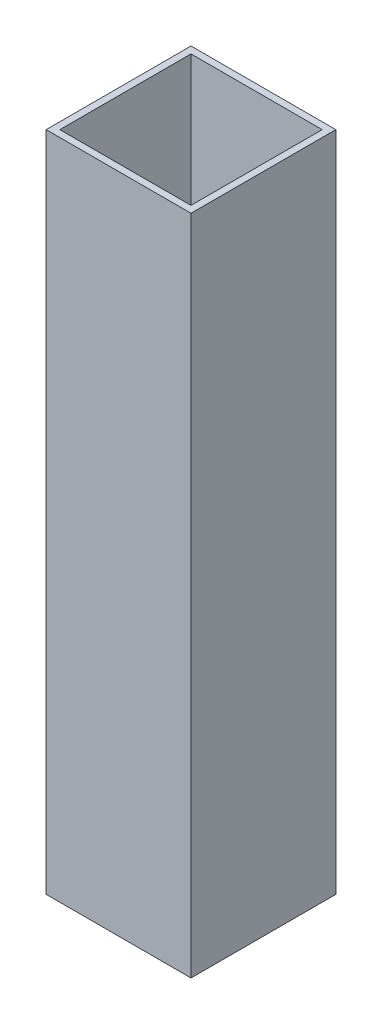
ISO-10303-21;
HEADER;
FILE_DESCRIPTION(('STEP AP214'),'2;1');
FILE_NAME('part.step','',(''),(''),'','','');
FILE_SCHEMA(('AUTOMOTIVE_DESIGN { 1 0 10303 214 1 1 1 1 }'));
ENDSEC;
DATA;
#1=APPLICATION_CONTEXT('core data for automotive mechanical design processes');
#2=APPLICATION_PROTOCOL_DEFINITION('international standard','automotive_design',2000,#1);
#3=PRODUCT_CONTEXT('',#1,'mechanical');
#4=PRODUCT('Part','Part','',(#3));
#5=PRODUCT_RELATED_PRODUCT_CATEGORY('part','',(#4));
#6=PRODUCT_DEFINITION_FORMATION('','',#4);
#7=PRODUCT_DEFINITION_CONTEXT('part definition',#1,'design');
#8=PRODUCT_DEFINITION('design','',#6,#7);
#9=PRODUCT_DEFINITION_SHAPE('','',#8);
#10=(LENGTH_UNIT() NAMED_UNIT(*) SI_UNIT(.MILLI.,.METRE.));
#11=(NAMED_UNIT(*) PLANE_ANGLE_UNIT() SI_UNIT($,.RADIAN.));
#12=(NAMED_UNIT(*) SI_UNIT($,.STERADIAN.) SOLID_ANGLE_UNIT());
#13=UNCERTAINTY_MEASURE_WITH_UNIT(LENGTH_MEASURE(1.E-05),#10,'distance_accuracy_value','');
#14=(GEOMETRIC_REPRESENTATION_CONTEXT(3) GLOBAL_UNCERTAINTY_ASSIGNED_CONTEXT((#13)) GLOBAL_UNIT_ASSIGNED_CONTEXT((#10,
#11,#12)) REPRESENTATION_CONTEXT('',''));
#15=CARTESIAN_POINT('',(0.,0.,0.));
#16=DIRECTION('',(0.,0.,1.));
#17=DIRECTION('',(1.,0.,0.));
#18=AXIS2_PLACEMENT_3D('',#15,#16,#17);
#19=CARTESIAN_POINT('',(0.,116.13,0.));
#20=DIRECTION('',(0.,1.,0.));
#21=DIRECTION('',(0.,0.,1.));
#22=AXIS2_PLACEMENT_3D('',#19,#20,#21);
#23=PLANE('',#22);
#24=DIRECTION('',(0.,0.,1.));
#25=VECTOR('',#24,1.);
#26=CARTESIAN_POINT('',(0.,116.13,-25.4));
#27=LINE('',#26,#25);
#28=CARTESIAN_POINT('',(0.,116.13,-25.4));
#29=VERTEX_POINT('',#28);
#30=CARTESIAN_POINT('',(0.,116.13,0.));
#31=VERTEX_POINT('',#30);
#32=EDGE_CURVE('E157',#29,#31,#27,.T.);
#33=ORIENTED_EDGE('',*,*,#32,.T.);
#34=DIRECTION('',(1.,0.,0.));
#35=VECTOR('',#34,1.);
#36=CARTESIAN_POINT('',(0.,116.13,0.));
#37=LINE('',#36,#35);
#38=CARTESIAN_POINT('',(25.4,116.13,0.));
#39=VERTEX_POINT('',#38);
#40=EDGE_CURVE('E161',#31,#39,#37,.T.);
#41=ORIENTED_EDGE('',*,*,#40,.T.);
#42=DIRECTION('',(0.,0.,-1.));
#43=VECTOR('',#42,1.);
#44=CARTESIAN_POINT('',(25.4,116.13,0.));
#45=LINE('',#44,#43);
#46=CARTESIAN_POINT('',(25.4,116.13,-25.4));
#47=VERTEX_POINT('',#46);
#48=EDGE_CURVE('E165',#39,#47,#45,.T.);
#49=ORIENTED_EDGE('',*,*,#48,.T.);
#50=DIRECTION('',(-1.,0.,0.));
#51=VECTOR('',#50,1.);
#52=CARTESIAN_POINT('',(25.4,116.13,-25.4));
#53=LINE('',#52,#51);
#54=EDGE_CURVE('E168',#47,#29,#53,.T.);
#55=ORIENTED_EDGE('',*,*,#54,.T.);
#56=EDGE_LOOP('',(#33,#41,#49,#55));
#57=FACE_BOUND('',#56,.T.);
#58=DIRECTION('',(0.,0.,1.));
#59=VECTOR('',#58,1.);
#60=CARTESIAN_POINT('',(1.2,116.13,-24.2));
#61=LINE('',#60,#59);
#62=CARTESIAN_POINT('',(1.2,116.13,-24.2));
#63=VERTEX_POINT('',#62);
#64=CARTESIAN_POINT('',(1.2,116.13,-1.2));
#65=VERTEX_POINT('',#64);
#66=EDGE_CURVE('E118',#63,#65,#61,.T.);
#67=ORIENTED_EDGE('',*,*,#66,.F.);
#68=DIRECTION('',(-1.,0.,0.));
#69=VECTOR('',#68,1.);
#70=CARTESIAN_POINT('',(24.2,116.13,-24.2));
#71=LINE('',#70,#69);
#72=CARTESIAN_POINT('',(24.2,116.13,-24.2));
#73=VERTEX_POINT('',#72);
#74=EDGE_CURVE('E109',#73,#63,#71,.T.);
#75=ORIENTED_EDGE('',*,*,#74,.F.);
#76=DIRECTION('',(0.,0.,-1.));
#77=VECTOR('',#76,1.);
#78=CARTESIAN_POINT('',(24.2,116.13,-1.2));
#79=LINE('',#78,#77);
#80=CARTESIAN_POINT('',(24.2,116.13,-1.2));
#81=VERTEX_POINT('',#80);
#82=EDGE_CURVE('E135',#81,#73,#79,.T.);
#83=ORIENTED_EDGE('',*,*,#82,.F.);
#84=DIRECTION('',(1.,0.,0.));
#85=VECTOR('',#84,1.);
#86=CARTESIAN_POINT('',(1.2,116.13,-1.2));
#87=LINE('',#86,#85);
#88=EDGE_CURVE('E131',#65,#81,#87,.T.);
#89=ORIENTED_EDGE('',*,*,#88,.F.);
#90=EDGE_LOOP('',(#67,#75,#83,#89));
#91=FACE_BOUND('',#90,.T.);
#92=ADVANCED_FACE('F43',(#57,#91),#23,.T.);
#93=CARTESIAN_POINT('',(0.,0.,0.));
#94=DIRECTION('',(0.,1.,0.));
#95=DIRECTION('',(0.,0.,1.));
#96=AXIS2_PLACEMENT_3D('',#93,#94,#95);
#97=PLANE('',#96);
#98=DIRECTION('',(0.,0.,1.));
#99=VECTOR('',#98,1.);
#100=CARTESIAN_POINT('',(0.,0.,-25.4));
#101=LINE('',#100,#99);
#102=CARTESIAN_POINT('',(0.,0.,-25.4));
#103=VERTEX_POINT('',#102);
#104=CARTESIAN_POINT('',(0.,0.,0.));
#105=VERTEX_POINT('',#104);
#106=EDGE_CURVE('E127',#103,#105,#101,.T.);
#107=ORIENTED_EDGE('',*,*,#106,.F.);
#108=DIRECTION('',(-1.,0.,0.));
#109=VECTOR('',#108,1.);
#110=CARTESIAN_POINT('',(25.4,0.,-25.4));
#111=LINE('',#110,#109);
#112=CARTESIAN_POINT('',(25.4,0.,-25.4));
#113=VERTEX_POINT('',#112);
#114=EDGE_CURVE('E162',#113,#103,#111,.T.);
#115=ORIENTED_EDGE('',*,*,#114,.F.);
#116=DIRECTION('',(0.,0.,-1.));
#117=VECTOR('',#116,1.);
#118=CARTESIAN_POINT('',(25.4,0.,0.));
#119=LINE('',#118,#117);
#120=CARTESIAN_POINT('',(25.4,0.,0.));
#121=VERTEX_POINT('',#120);
#122=EDGE_CURVE('E178',#121,#113,#119,.T.);
#123=ORIENTED_EDGE('',*,*,#122,.F.);
#124=DIRECTION('',(1.,0.,0.));
#125=VECTOR('',#124,1.);
#126=CARTESIAN_POINT('',(0.,0.,0.));
#127=LINE('',#126,#125);
#128=EDGE_CURVE('E175',#105,#121,#127,.T.);
#129=ORIENTED_EDGE('',*,*,#128,.F.);
#130=EDGE_LOOP('',(#107,#115,#123,#129));
#131=FACE_BOUND('',#130,.T.);
#132=DIRECTION('',(-1.,0.,0.));
#133=VECTOR('',#132,1.);
#134=CARTESIAN_POINT('',(24.2,0.,-24.2));
#135=LINE('',#134,#133);
#136=CARTESIAN_POINT('',(24.2,0.,-24.2));
#137=VERTEX_POINT('',#136);
#138=CARTESIAN_POINT('',(1.2,0.,-24.2));
#139=VERTEX_POINT('',#138);
#140=EDGE_CURVE('E67',#137,#139,#135,.T.);
#141=ORIENTED_EDGE('',*,*,#140,.T.);
#142=DIRECTION('',(0.,0.,1.));
#143=VECTOR('',#142,1.);
#144=CARTESIAN_POINT('',(1.2,0.,-24.2));
#145=LINE('',#144,#143);
#146=CARTESIAN_POINT('',(1.2,0.,-1.2));
#147=VERTEX_POINT('',#146);
#148=EDGE_CURVE('E125',#139,#147,#145,.T.);
#149=ORIENTED_EDGE('',*,*,#148,.T.);
#150=DIRECTION('',(1.,0.,0.));
#151=VECTOR('',#150,1.);
#152=CARTESIAN_POINT('',(1.2,0.,-1.2));
#153=LINE('',#152,#151);
#154=CARTESIAN_POINT('',(24.2,0.,-1.2));
#155=VERTEX_POINT('',#154);
#156=EDGE_CURVE('E144',#147,#155,#153,.T.);
#157=ORIENTED_EDGE('',*,*,#156,.T.);
#158=DIRECTION('',(0.,0.,-1.));
#159=VECTOR('',#158,1.);
#160=CARTESIAN_POINT('',(24.2,0.,-1.2));
#161=LINE('',#160,#159);
#162=EDGE_CURVE('E119',#155,#137,#161,.T.);
#163=ORIENTED_EDGE('',*,*,#162,.T.);
#164=EDGE_LOOP('',(#141,#149,#157,#163));
#165=FACE_BOUND('',#164,.T.);
#166=ADVANCED_FACE('F201',(#131,#165),#97,.F.);
#167=CARTESIAN_POINT('',(0.,116.13,-25.4));
#168=DIRECTION('',(1.,0.,0.));
#169=DIRECTION('',(0.,0.,-1.));
#170=AXIS2_PLACEMENT_3D('',#167,#168,#169);
#171=PLANE('',#170);
#172=ORIENTED_EDGE('',*,*,#106,.T.);
#173=DIRECTION('',(0.,-1.,0.));
#174=VECTOR('',#173,1.);
#175=CARTESIAN_POINT('',(0.,116.13,0.));
#176=LINE('',#175,#174);
#177=EDGE_CURVE('E11',#31,#105,#176,.T.);
#178=ORIENTED_EDGE('',*,*,#177,.F.);
#179=ORIENTED_EDGE('',*,*,#32,.F.);
#180=DIRECTION('',(0.,-1.,0.));
#181=VECTOR('',#180,1.);
#182=CARTESIAN_POINT('',(0.,116.13,-25.4));
#183=LINE('',#182,#181);
#184=EDGE_CURVE('E171',#29,#103,#183,.T.);
#185=ORIENTED_EDGE('',*,*,#184,.T.);
#186=EDGE_LOOP('',(#172,#178,#179,#185));
#187=FACE_BOUND('',#186,.T.);
#188=ADVANCED_FACE('F45',(#187),#171,.F.);
#189=CARTESIAN_POINT('',(0.,116.13,0.));
#190=DIRECTION('',(0.,0.,-1.));
#191=DIRECTION('',(-1.,0.,0.));
#192=AXIS2_PLACEMENT_3D('',#189,#190,#191);
#193=PLANE('',#192);
#194=ORIENTED_EDGE('',*,*,#128,.T.);
#195=DIRECTION('',(0.,-1.,0.));
#196=VECTOR('',#195,1.);
#197=CARTESIAN_POINT('',(25.4,116.13,0.));
#198=LINE('',#197,#196);
#199=EDGE_CURVE('E52',#39,#121,#198,.T.);
#200=ORIENTED_EDGE('',*,*,#199,.F.);
#201=ORIENTED_EDGE('',*,*,#40,.F.);
#202=ORIENTED_EDGE('',*,*,#177,.T.);
#203=EDGE_LOOP('',(#194,#200,#201,#202));
#204=FACE_BOUND('',#203,.T.);
#205=ADVANCED_FACE('F211',(#204),#193,.F.);
#206=CARTESIAN_POINT('',(25.4,116.13,0.));
#207=DIRECTION('',(-1.,0.,0.));
#208=DIRECTION('',(0.,0.,1.));
#209=AXIS2_PLACEMENT_3D('',#206,#207,#208);
#210=PLANE('',#209);
#211=ORIENTED_EDGE('',*,*,#122,.T.);
#212=DIRECTION('',(0.,-1.,0.));
#213=VECTOR('',#212,1.);
#214=CARTESIAN_POINT('',(25.4,116.13,-25.4));
#215=LINE('',#214,#213);
#216=EDGE_CURVE('E186',#47,#113,#215,.T.);
#217=ORIENTED_EDGE('',*,*,#216,.F.);
#218=ORIENTED_EDGE('',*,*,#48,.F.);
#219=ORIENTED_EDGE('',*,*,#199,.T.);
#220=EDGE_LOOP('',(#211,#217,#218,#219));
#221=FACE_BOUND('',#220,.T.);
#222=ADVANCED_FACE('F195',(#221),#210,.F.);
#223=CARTESIAN_POINT('',(25.4,116.13,-25.4));
#224=DIRECTION('',(0.,0.,1.));
#225=DIRECTION('',(1.,0.,0.));
#226=AXIS2_PLACEMENT_3D('',#223,#224,#225);
#227=PLANE('',#226);
#228=ORIENTED_EDGE('',*,*,#114,.T.);
#229=ORIENTED_EDGE('',*,*,#184,.F.);
#230=ORIENTED_EDGE('',*,*,#54,.F.);
#231=ORIENTED_EDGE('',*,*,#216,.T.);
#232=EDGE_LOOP('',(#228,#229,#230,#231));
#233=FACE_BOUND('',#232,.T.);
#234=ADVANCED_FACE('F205',(#233),#227,.F.);
#235=CARTESIAN_POINT('',(24.2,116.13,-24.2));
#236=DIRECTION('',(0.,0.,1.));
#237=DIRECTION('',(1.,0.,0.));
#238=AXIS2_PLACEMENT_3D('',#235,#236,#237);
#239=PLANE('',#238);
#240=ORIENTED_EDGE('',*,*,#140,.F.);
#241=DIRECTION('',(0.,-1.,0.));
#242=VECTOR('',#241,1.);
#243=CARTESIAN_POINT('',(24.2,116.13,-24.2));
#244=LINE('',#243,#242);
#245=EDGE_CURVE('E113',#73,#137,#244,.T.);
#246=ORIENTED_EDGE('',*,*,#245,.F.);
#247=ORIENTED_EDGE('',*,*,#74,.T.);
#248=DIRECTION('',(0.,-1.,0.));
#249=VECTOR('',#248,1.);
#250=CARTESIAN_POINT('',(1.2,116.13,-24.2));
#251=LINE('',#250,#249);
#252=EDGE_CURVE('E112',#63,#139,#251,.T.);
#253=ORIENTED_EDGE('',*,*,#252,.T.);
#254=EDGE_LOOP('',(#240,#246,#247,#253));
#255=FACE_BOUND('',#254,.T.);
#256=ADVANCED_FACE('F111',(#255),#239,.T.);
#257=CARTESIAN_POINT('',(1.2,116.13,-24.2));
#258=DIRECTION('',(1.,0.,0.));
#259=DIRECTION('',(0.,0.,-1.));
#260=AXIS2_PLACEMENT_3D('',#257,#258,#259);
#261=PLANE('',#260);
#262=ORIENTED_EDGE('',*,*,#148,.F.);
#263=ORIENTED_EDGE('',*,*,#252,.F.);
#264=ORIENTED_EDGE('',*,*,#66,.T.);
#265=DIRECTION('',(0.,-1.,0.));
#266=VECTOR('',#265,1.);
#267=CARTESIAN_POINT('',(1.2,116.13,-1.2));
#268=LINE('',#267,#266);
#269=EDGE_CURVE('E128',#65,#147,#268,.T.);
#270=ORIENTED_EDGE('',*,*,#269,.T.);
#271=EDGE_LOOP('',(#262,#263,#264,#270));
#272=FACE_BOUND('',#271,.T.);
#273=ADVANCED_FACE('F122',(#272),#261,.T.);
#274=CARTESIAN_POINT('',(1.2,116.13,-1.2));
#275=DIRECTION('',(0.,0.,-1.));
#276=DIRECTION('',(-1.,0.,0.));
#277=AXIS2_PLACEMENT_3D('',#274,#275,#276);
#278=PLANE('',#277);
#279=ORIENTED_EDGE('',*,*,#156,.F.);
#280=ORIENTED_EDGE('',*,*,#269,.F.);
#281=ORIENTED_EDGE('',*,*,#88,.T.);
#282=DIRECTION('',(0.,-1.,0.));
#283=VECTOR('',#282,1.);
#284=CARTESIAN_POINT('',(24.2,116.13,-1.2));
#285=LINE('',#284,#283);
#286=EDGE_CURVE('E59',#81,#155,#285,.T.);
#287=ORIENTED_EDGE('',*,*,#286,.T.);
#288=EDGE_LOOP('',(#279,#280,#281,#287));
#289=FACE_BOUND('',#288,.T.);
#290=ADVANCED_FACE('F234',(#289),#278,.T.);
#291=CARTESIAN_POINT('',(24.2,116.13,-1.2));
#292=DIRECTION('',(-1.,0.,0.));
#293=DIRECTION('',(0.,0.,1.));
#294=AXIS2_PLACEMENT_3D('',#291,#292,#293);
#295=PLANE('',#294);
#296=ORIENTED_EDGE('',*,*,#162,.F.);
#297=ORIENTED_EDGE('',*,*,#286,.F.);
#298=ORIENTED_EDGE('',*,*,#82,.T.);
#299=ORIENTED_EDGE('',*,*,#245,.T.);
#300=EDGE_LOOP('',(#296,#297,#298,#299));
#301=FACE_BOUND('',#300,.T.);
#302=ADVANCED_FACE('F238',(#301),#295,.T.);
#303=CLOSED_SHELL('',(#92,#166,#188,#205,#222,#234,#256,#273,#290,#302));
#304=MANIFOLD_SOLID_BREP('B2',#303);
#305=ADVANCED_BREP_SHAPE_REPRESENTATION('',(#18,#304),#14);
#306=SHAPE_DEFINITION_REPRESENTATION(#9,#305);
ENDSEC;
END-ISO-10303-21;
